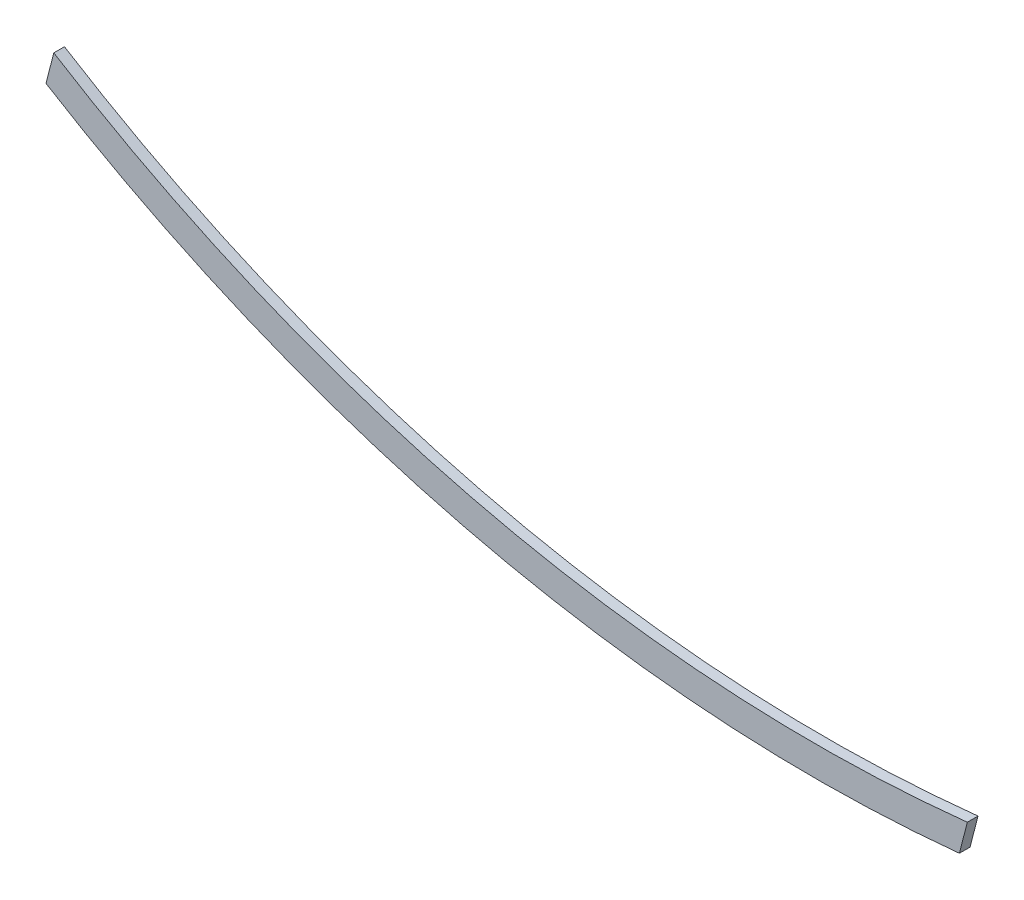
ISO-10303-21;
HEADER;
FILE_DESCRIPTION(('STEP AP214'),'2;1');
FILE_NAME('part.step','',(''),(''),'','','');
FILE_SCHEMA(('AUTOMOTIVE_DESIGN { 1 0 10303 214 1 1 1 1 }'));
ENDSEC;
DATA;
#1=APPLICATION_CONTEXT('core data for automotive mechanical design processes');
#2=APPLICATION_PROTOCOL_DEFINITION('international standard','automotive_design',2000,#1);
#3=PRODUCT_CONTEXT('',#1,'mechanical');
#4=PRODUCT('Part','Part','',(#3));
#5=PRODUCT_RELATED_PRODUCT_CATEGORY('part','',(#4));
#6=PRODUCT_DEFINITION_FORMATION('','',#4);
#7=PRODUCT_DEFINITION_CONTEXT('part definition',#1,'design');
#8=PRODUCT_DEFINITION('design','',#6,#7);
#9=PRODUCT_DEFINITION_SHAPE('','',#8);
#10=(LENGTH_UNIT() NAMED_UNIT(*) SI_UNIT(.MILLI.,.METRE.));
#11=(NAMED_UNIT(*) PLANE_ANGLE_UNIT() SI_UNIT($,.RADIAN.));
#12=(NAMED_UNIT(*) SI_UNIT($,.STERADIAN.) SOLID_ANGLE_UNIT());
#13=UNCERTAINTY_MEASURE_WITH_UNIT(LENGTH_MEASURE(1.E-05),#10,'distance_accuracy_value','');
#14=(GEOMETRIC_REPRESENTATION_CONTEXT(3) GLOBAL_UNCERTAINTY_ASSIGNED_CONTEXT((#13)) GLOBAL_UNIT_ASSIGNED_CONTEXT((#10,
#11,#12)) REPRESENTATION_CONTEXT('',''));
#15=CARTESIAN_POINT('',(0.,0.,0.));
#16=DIRECTION('',(0.,0.,1.));
#17=DIRECTION('',(1.,0.,0.));
#18=AXIS2_PLACEMENT_3D('',#15,#16,#17);
#19=CARTESIAN_POINT('',(-4134.41016527234,1064.70904452557,50.));
#20=DIRECTION('',(0.968706388518134,-0.248209453575312,0.));
#21=DIRECTION('',(0.248209453575312,0.968706388518134,0.));
#22=AXIS2_PLACEMENT_3D('',#19,#20,#21);
#23=PLANE('',#22);
#24=DIRECTION('',(-0.248209453575312,-0.968706388518134,0.));
#25=VECTOR('',#24,1.);
#26=CARTESIAN_POINT('',(-4134.41016527234,1064.70904452557,0.));
#27=LINE('',#26,#25);
#28=CARTESIAN_POINT('',(-4134.41016527234,1064.70904452557,0.));
#29=VERTEX_POINT('',#28);
#30=CARTESIAN_POINT('',(-4170.8210204042,922.605561078089,0.));
#31=VERTEX_POINT('',#30);
#32=EDGE_CURVE('E87',#29,#31,#27,.T.);
#33=ORIENTED_EDGE('',*,*,#32,.T.);
#34=DIRECTION('',(0.,0.,-1.));
#35=VECTOR('',#34,1.);
#36=CARTESIAN_POINT('',(-4170.8210204042,922.605561078089,50.));
#37=LINE('',#36,#35);
#38=CARTESIAN_POINT('',(-4170.8210204042,922.605561078089,50.));
#39=VERTEX_POINT('',#38);
#40=EDGE_CURVE('E41',#39,#31,#37,.T.);
#41=ORIENTED_EDGE('',*,*,#40,.F.);
#42=DIRECTION('',(-0.248209453575312,-0.968706388518134,0.));
#43=VECTOR('',#42,1.);
#44=CARTESIAN_POINT('',(-4134.41016527234,1064.70904452557,50.));
#45=LINE('',#44,#43);
#46=CARTESIAN_POINT('',(-4134.41016527234,1064.70904452557,50.));
#47=VERTEX_POINT('',#46);
#48=EDGE_CURVE('E78',#47,#39,#45,.T.);
#49=ORIENTED_EDGE('',*,*,#48,.F.);
#50=DIRECTION('',(0.,0.,-1.));
#51=VECTOR('',#50,1.);
#52=CARTESIAN_POINT('',(-4134.41016527234,1064.70904452557,50.));
#53=LINE('',#52,#51);
#54=EDGE_CURVE('E11',#47,#29,#53,.T.);
#55=ORIENTED_EDGE('',*,*,#54,.T.);
#56=EDGE_LOOP('',(#33,#41,#49,#55));
#57=FACE_BOUND('',#56,.T.);
#58=ADVANCED_FACE('F33',(#57),#23,.F.);
#59=CARTESIAN_POINT('',(-573.19337776581,6778.76936569503,50.));
#60=DIRECTION('',(0.,0.,-1.));
#61=DIRECTION('',(-1.,0.,0.));
#62=AXIS2_PLACEMENT_3D('',#59,#60,#61);
#63=CYLINDRICAL_SURFACE('',#62,6872.96000000002);
#64=CARTESIAN_POINT('',(-573.19337776581,6778.76936569503,0.));
#65=DIRECTION('',(0.,0.,1.));
#66=DIRECTION('',(1.,0.,0.));
#67=AXIS2_PLACEMENT_3D('',#64,#65,#66);
#68=CIRCLE('',#67,6872.96000000002);
#69=CARTESIAN_POINT('',(105.481064021814,-60.6005002841785,0.));
#70=VERTEX_POINT('',#69);
#71=EDGE_CURVE('E66',#31,#70,#68,.T.);
#72=ORIENTED_EDGE('',*,*,#71,.T.);
#73=DIRECTION('',(0.,0.,-1.));
#74=VECTOR('',#73,1.);
#75=CARTESIAN_POINT('',(105.481064021814,-60.6005002841785,50.));
#76=LINE('',#75,#74);
#77=CARTESIAN_POINT('',(105.481064021814,-60.6005002841785,50.));
#78=VERTEX_POINT('',#77);
#79=EDGE_CURVE('E88',#78,#70,#76,.T.);
#80=ORIENTED_EDGE('',*,*,#79,.F.);
#81=CARTESIAN_POINT('',(-573.193377763528,6778.76936569524,50.));
#82=DIRECTION('',(0.,0.,1.));
#83=DIRECTION('',(-1.,0.,0.));
#84=AXIS2_PLACEMENT_3D('',#81,#82,#83);
#85=CIRCLE('',#84,6872.96000000002);
#86=EDGE_CURVE('E82',#39,#78,#85,.T.);
#87=ORIENTED_EDGE('',*,*,#86,.F.);
#88=ORIENTED_EDGE('',*,*,#40,.T.);
#89=EDGE_LOOP('',(#72,#80,#87,#88));
#90=FACE_BOUND('',#89,.T.);
#91=ADVANCED_FACE('F89',(#90),#63,.T.);
#92=CARTESIAN_POINT('',(105.481064021814,-60.6005002841785,50.));
#93=DIRECTION('',(-0.968706388518142,0.248209453575278,0.));
#94=DIRECTION('',(-0.248209453575278,-0.968706388518142,0.));
#95=AXIS2_PLACEMENT_3D('',#92,#93,#94);
#96=PLANE('',#95);
#97=DIRECTION('',(0.248209453575278,0.968706388518142,0.));
#98=VECTOR('',#97,1.);
#99=CARTESIAN_POINT('',(105.481064021814,-60.6005002841785,0.));
#100=LINE('',#99,#98);
#101=CARTESIAN_POINT('',(142.520881473013,83.9576834501061,0.));
#102=VERTEX_POINT('',#101);
#103=EDGE_CURVE('E73',#70,#102,#100,.T.);
#104=ORIENTED_EDGE('',*,*,#103,.T.);
#105=DIRECTION('',(0.,0.,-1.));
#106=VECTOR('',#105,1.);
#107=CARTESIAN_POINT('',(142.520881473013,83.9576834501061,50.));
#108=LINE('',#107,#106);
#109=CARTESIAN_POINT('',(142.520881473013,83.9576834501061,50.));
#110=VERTEX_POINT('',#109);
#111=EDGE_CURVE('E93',#110,#102,#108,.T.);
#112=ORIENTED_EDGE('',*,*,#111,.F.);
#113=DIRECTION('',(0.248209453575278,0.968706388518142,0.));
#114=VECTOR('',#113,1.);
#115=CARTESIAN_POINT('',(105.481064021814,-60.6005002841785,50.));
#116=LINE('',#115,#114);
#117=EDGE_CURVE('E91',#78,#110,#116,.T.);
#118=ORIENTED_EDGE('',*,*,#117,.F.);
#119=ORIENTED_EDGE('',*,*,#79,.T.);
#120=EDGE_LOOP('',(#104,#112,#118,#119));
#121=FACE_BOUND('',#120,.T.);
#122=ADVANCED_FACE('F103',(#121),#96,.F.);
#123=CARTESIAN_POINT('',(-573.193377763528,6778.76936569524,50.));
#124=DIRECTION('',(0.,0.,-1.));
#125=DIRECTION('',(-1.,0.,0.));
#126=AXIS2_PLACEMENT_3D('',#123,#124,#125);
#127=CYLINDRICAL_SURFACE('',#126,6732.96000000003);
#128=CARTESIAN_POINT('',(-573.193377763528,6778.76936569524,0.));
#129=DIRECTION('',(0.,0.,-1.));
#130=DIRECTION('',(1.,0.,0.));
#131=AXIS2_PLACEMENT_3D('',#128,#129,#130);
#132=CIRCLE('',#131,6732.96000000003);
#133=EDGE_CURVE('E100',#102,#29,#132,.T.);
#134=ORIENTED_EDGE('',*,*,#133,.T.);
#135=ORIENTED_EDGE('',*,*,#54,.F.);
#136=CARTESIAN_POINT('',(-573.193377763528,6778.76936569524,50.));
#137=DIRECTION('',(0.,0.,-1.));
#138=DIRECTION('',(-1.,0.,0.));
#139=AXIS2_PLACEMENT_3D('',#136,#137,#138);
#140=CIRCLE('',#139,6732.96000000002);
#141=EDGE_CURVE('E49',#110,#47,#140,.T.);
#142=ORIENTED_EDGE('',*,*,#141,.F.);
#143=ORIENTED_EDGE('',*,*,#111,.T.);
#144=EDGE_LOOP('',(#134,#135,#142,#143));
#145=FACE_BOUND('',#144,.T.);
#146=ADVANCED_FACE('F107',(#145),#127,.F.);
#147=CARTESIAN_POINT('',(-573.193377763528,6778.76936569524,50.));
#148=DIRECTION('',(0.,0.,-1.));
#149=DIRECTION('',(-1.,0.,0.));
#150=AXIS2_PLACEMENT_3D('',#147,#148,#149);
#151=PLANE('',#150);
#152=ORIENTED_EDGE('',*,*,#141,.T.);
#153=ORIENTED_EDGE('',*,*,#48,.T.);
#154=ORIENTED_EDGE('',*,*,#86,.T.);
#155=ORIENTED_EDGE('',*,*,#117,.T.);
#156=EDGE_LOOP('',(#152,#153,#154,#155));
#157=FACE_BOUND('',#156,.T.);
#158=ADVANCED_FACE('F80',(#157),#151,.F.);
#159=CARTESIAN_POINT('',(-573.193377763528,6778.76936569524,0.));
#160=DIRECTION('',(0.,0.,-1.));
#161=DIRECTION('',(-1.,0.,0.));
#162=AXIS2_PLACEMENT_3D('',#159,#160,#161);
#163=PLANE('',#162);
#164=ORIENTED_EDGE('',*,*,#32,.F.);
#165=ORIENTED_EDGE('',*,*,#133,.F.);
#166=ORIENTED_EDGE('',*,*,#103,.F.);
#167=ORIENTED_EDGE('',*,*,#71,.F.);
#168=EDGE_LOOP('',(#164,#165,#166,#167));
#169=FACE_BOUND('',#168,.T.);
#170=ADVANCED_FACE('F106',(#169),#163,.T.);
#171=CLOSED_SHELL('',(#58,#91,#122,#146,#158,#170));
#172=MANIFOLD_SOLID_BREP('B2',#171);
#173=ADVANCED_BREP_SHAPE_REPRESENTATION('',(#18,#172),#14);
#174=SHAPE_DEFINITION_REPRESENTATION(#9,#173);
ENDSEC;
END-ISO-10303-21;
